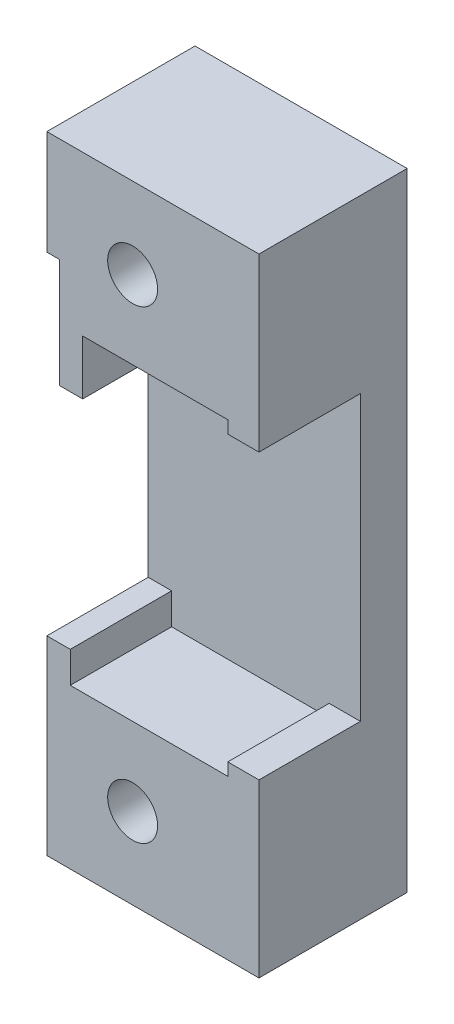
ISO-10303-21;
HEADER;
FILE_DESCRIPTION(('STEP AP214'),'2;1');
FILE_NAME('part.step','',(''),(''),'','','');
FILE_SCHEMA(('AUTOMOTIVE_DESIGN { 1 0 10303 214 1 1 1 1 }'));
ENDSEC;
DATA;
#1=APPLICATION_CONTEXT('core data for automotive mechanical design processes');
#2=APPLICATION_PROTOCOL_DEFINITION('international standard','automotive_design',2000,#1);
#3=PRODUCT_CONTEXT('',#1,'mechanical');
#4=PRODUCT('Part','Part','',(#3));
#5=PRODUCT_RELATED_PRODUCT_CATEGORY('part','',(#4));
#6=PRODUCT_DEFINITION_FORMATION('','',#4);
#7=PRODUCT_DEFINITION_CONTEXT('part definition',#1,'design');
#8=PRODUCT_DEFINITION('design','',#6,#7);
#9=PRODUCT_DEFINITION_SHAPE('','',#8);
#10=(LENGTH_UNIT() NAMED_UNIT(*) SI_UNIT(.MILLI.,.METRE.));
#11=(NAMED_UNIT(*) PLANE_ANGLE_UNIT() SI_UNIT($,.RADIAN.));
#12=(NAMED_UNIT(*) SI_UNIT($,.STERADIAN.) SOLID_ANGLE_UNIT());
#13=UNCERTAINTY_MEASURE_WITH_UNIT(LENGTH_MEASURE(1.E-05),#10,'distance_accuracy_value','');
#14=(GEOMETRIC_REPRESENTATION_CONTEXT(3) GLOBAL_UNCERTAINTY_ASSIGNED_CONTEXT((#13)) GLOBAL_UNIT_ASSIGNED_CONTEXT((#10,
#11,#12)) REPRESENTATION_CONTEXT('',''));
#15=CARTESIAN_POINT('',(0.,0.,0.));
#16=DIRECTION('',(0.,0.,1.));
#17=DIRECTION('',(1.,0.,0.));
#18=AXIS2_PLACEMENT_3D('',#15,#16,#17);
#19=CARTESIAN_POINT('',(-10.1,0.,6.5));
#20=DIRECTION('',(1.,0.,0.));
#21=DIRECTION('',(0.,0.,-1.));
#22=AXIS2_PLACEMENT_3D('',#19,#20,#21);
#23=PLANE('',#22);
#24=DIRECTION('',(0.,-1.,0.));
#25=VECTOR('',#24,1.);
#26=CARTESIAN_POINT('',(-10.1,0.,0.));
#27=LINE('',#26,#25);
#28=CARTESIAN_POINT('',(-10.1,-7.9,0.));
#29=VERTEX_POINT('',#28);
#30=CARTESIAN_POINT('',(-10.1,-9.9,0.));
#31=VERTEX_POINT('',#30);
#32=EDGE_CURVE('E306',#29,#31,#27,.T.);
#33=ORIENTED_EDGE('',*,*,#32,.F.);
#34=DIRECTION('',(0.,0.,-1.));
#35=VECTOR('',#34,1.);
#36=CARTESIAN_POINT('',(-10.1,-7.9,6.5));
#37=LINE('',#36,#35);
#38=CARTESIAN_POINT('',(-10.1,-7.9,6.5));
#39=VERTEX_POINT('',#38);
#40=EDGE_CURVE('E11',#39,#29,#37,.T.);
#41=ORIENTED_EDGE('',*,*,#40,.F.);
#42=DIRECTION('',(0.,-1.,0.));
#43=VECTOR('',#42,1.);
#44=CARTESIAN_POINT('',(-10.1,0.,6.5));
#45=LINE('',#44,#43);
#46=CARTESIAN_POINT('',(-10.1,-9.9,6.5));
#47=VERTEX_POINT('',#46);
#48=EDGE_CURVE('E309',#39,#47,#45,.T.);
#49=ORIENTED_EDGE('',*,*,#48,.T.);
#50=DIRECTION('',(0.,0.,-1.));
#51=VECTOR('',#50,1.);
#52=CARTESIAN_POINT('',(-10.1,-9.9,6.5));
#53=LINE('',#52,#51);
#54=EDGE_CURVE('E344',#47,#31,#53,.T.);
#55=ORIENTED_EDGE('',*,*,#54,.T.);
#56=EDGE_LOOP('',(#33,#41,#49,#55));
#57=FACE_BOUND('',#56,.T.);
#58=ADVANCED_FACE('F47',(#57),#23,.T.);
#59=CARTESIAN_POINT('',(0.,-7.9,6.5));
#60=DIRECTION('',(0.,1.,0.));
#61=DIRECTION('',(0.,0.,1.));
#62=AXIS2_PLACEMENT_3D('',#59,#60,#61);
#63=PLANE('',#62);
#64=DIRECTION('',(1.,0.,0.));
#65=VECTOR('',#64,1.);
#66=CARTESIAN_POINT('',(0.,-7.9,0.));
#67=LINE('',#66,#65);
#68=CARTESIAN_POINT('',(-11.6,-7.9,0.));
#69=VERTEX_POINT('',#68);
#70=EDGE_CURVE('E348',#69,#29,#67,.T.);
#71=ORIENTED_EDGE('',*,*,#70,.F.);
#72=DIRECTION('',(0.,0.,-1.));
#73=VECTOR('',#72,1.);
#74=CARTESIAN_POINT('',(-11.6,-7.9,6.5));
#75=LINE('',#74,#73);
#76=CARTESIAN_POINT('',(-11.6,-7.9,6.5));
#77=VERTEX_POINT('',#76);
#78=EDGE_CURVE('E56',#77,#69,#75,.T.);
#79=ORIENTED_EDGE('',*,*,#78,.F.);
#80=DIRECTION('',(1.,0.,0.));
#81=VECTOR('',#80,1.);
#82=CARTESIAN_POINT('',(0.,-7.9,6.5));
#83=LINE('',#82,#81);
#84=EDGE_CURVE('E313',#77,#39,#83,.T.);
#85=ORIENTED_EDGE('',*,*,#84,.T.);
#86=ORIENTED_EDGE('',*,*,#40,.T.);
#87=EDGE_LOOP('',(#71,#79,#85,#86));
#88=FACE_BOUND('',#87,.T.);
#89=ADVANCED_FACE('F420',(#88),#63,.T.);
#90=CARTESIAN_POINT('',(-11.6,0.,6.5));
#91=DIRECTION('',(-1.,0.,0.));
#92=DIRECTION('',(0.,-1.,0.));
#93=AXIS2_PLACEMENT_3D('',#90,#91,#92);
#94=PLANE('',#93);
#95=ORIENTED_EDGE('',*,*,#78,.T.);
#96=DIRECTION('',(0.,1.,0.));
#97=VECTOR('',#96,1.);
#98=CARTESIAN_POINT('',(-11.6,0.,0.));
#99=LINE('',#98,#97);
#100=CARTESIAN_POINT('',(-11.6,13.4,0.));
#101=VERTEX_POINT('',#100);
#102=EDGE_CURVE('E180',#69,#101,#99,.T.);
#103=ORIENTED_EDGE('',*,*,#102,.T.);
#104=DIRECTION('',(0.,0.,-1.));
#105=VECTOR('',#104,1.);
#106=CARTESIAN_POINT('',(-11.6,13.4,6.5));
#107=LINE('',#106,#105);
#108=CARTESIAN_POINT('',(-11.6,13.4,6.5));
#109=VERTEX_POINT('',#108);
#110=EDGE_CURVE('E174',#109,#101,#107,.T.);
#111=ORIENTED_EDGE('',*,*,#110,.F.);
#112=DIRECTION('',(0.,1.,0.));
#113=VECTOR('',#112,1.);
#114=CARTESIAN_POINT('',(-11.6,0.,6.5));
#115=LINE('',#114,#113);
#116=CARTESIAN_POINT('',(-11.6,20.1,6.5));
#117=VERTEX_POINT('',#116);
#118=EDGE_CURVE('E178',#109,#117,#115,.T.);
#119=ORIENTED_EDGE('',*,*,#118,.T.);
#120=DIRECTION('',(0.,0.,1.));
#121=VECTOR('',#120,1.);
#122=CARTESIAN_POINT('',(-11.6,20.1,-3.));
#123=LINE('',#122,#121);
#124=CARTESIAN_POINT('',(-11.6,20.1,-3.));
#125=VERTEX_POINT('',#124);
#126=EDGE_CURVE('E303',#125,#117,#123,.T.);
#127=ORIENTED_EDGE('',*,*,#126,.F.);
#128=DIRECTION('',(0.,1.,0.));
#129=VECTOR('',#128,1.);
#130=CARTESIAN_POINT('',(-11.6,0.,-3.));
#131=LINE('',#130,#129);
#132=CARTESIAN_POINT('',(-11.6,-20.1,-3.));
#133=VERTEX_POINT('',#132);
#134=EDGE_CURVE('E282',#133,#125,#131,.T.);
#135=ORIENTED_EDGE('',*,*,#134,.F.);
#136=DIRECTION('',(0.,0.,-1.));
#137=VECTOR('',#136,1.);
#138=CARTESIAN_POINT('',(-11.6,-20.1,6.5));
#139=LINE('',#138,#137);
#140=CARTESIAN_POINT('',(-11.6,-20.1,6.5));
#141=VERTEX_POINT('',#140);
#142=EDGE_CURVE('E377',#141,#133,#139,.T.);
#143=ORIENTED_EDGE('',*,*,#142,.F.);
#144=DIRECTION('',(0.,1.,0.));
#145=VECTOR('',#144,1.);
#146=CARTESIAN_POINT('',(-11.6,0.,6.5));
#147=LINE('',#146,#145);
#148=EDGE_CURVE('E318',#141,#77,#147,.T.);
#149=ORIENTED_EDGE('',*,*,#148,.T.);
#150=EDGE_LOOP('',(#95,#103,#111,#119,#127,#135,#143,#149));
#151=FACE_BOUND('',#150,.T.);
#152=ADVANCED_FACE('F176',(#151),#94,.T.);
#153=CARTESIAN_POINT('',(0.,-20.1,6.5));
#154=DIRECTION('',(0.,-1.,0.));
#155=DIRECTION('',(0.,0.,-1.));
#156=AXIS2_PLACEMENT_3D('',#153,#154,#155);
#157=PLANE('',#156);
#158=ORIENTED_EDGE('',*,*,#142,.T.);
#159=DIRECTION('',(-1.,0.,0.));
#160=VECTOR('',#159,1.);
#161=CARTESIAN_POINT('',(0.,-20.1,-3.));
#162=LINE('',#161,#160);
#163=CARTESIAN_POINT('',(2.,-20.1,-3.));
#164=VERTEX_POINT('',#163);
#165=EDGE_CURVE('E285',#164,#133,#162,.T.);
#166=ORIENTED_EDGE('',*,*,#165,.F.);
#167=DIRECTION('',(0.,0.,-1.));
#168=VECTOR('',#167,1.);
#169=CARTESIAN_POINT('',(2.,-20.1,6.5));
#170=LINE('',#169,#168);
#171=CARTESIAN_POINT('',(2.,-20.1,6.5));
#172=VERTEX_POINT('',#171);
#173=EDGE_CURVE('E374',#172,#164,#170,.T.);
#174=ORIENTED_EDGE('',*,*,#173,.F.);
#175=DIRECTION('',(-1.,0.,0.));
#176=VECTOR('',#175,1.);
#177=CARTESIAN_POINT('',(0.,-20.1,6.5));
#178=LINE('',#177,#176);
#179=EDGE_CURVE('E322',#172,#141,#178,.T.);
#180=ORIENTED_EDGE('',*,*,#179,.T.);
#181=EDGE_LOOP('',(#158,#166,#174,#180));
#182=FACE_BOUND('',#181,.T.);
#183=ADVANCED_FACE('F498',(#182),#157,.T.);
#184=CARTESIAN_POINT('',(2.,0.,6.5));
#185=DIRECTION('',(1.,0.,0.));
#186=DIRECTION('',(0.,1.,0.));
#187=AXIS2_PLACEMENT_3D('',#184,#185,#186);
#188=PLANE('',#187);
#189=ORIENTED_EDGE('',*,*,#173,.T.);
#190=DIRECTION('',(0.,1.,0.));
#191=VECTOR('',#190,1.);
#192=CARTESIAN_POINT('',(2.,0.,-3.));
#193=LINE('',#192,#191);
#194=CARTESIAN_POINT('',(2.,20.1,-3.));
#195=VERTEX_POINT('',#194);
#196=EDGE_CURVE('E290',#164,#195,#193,.T.);
#197=ORIENTED_EDGE('',*,*,#196,.T.);
#198=DIRECTION('',(0.,0.,1.));
#199=VECTOR('',#198,1.);
#200=CARTESIAN_POINT('',(2.,20.1,-3.));
#201=LINE('',#200,#199);
#202=CARTESIAN_POINT('',(2.,20.1,6.5));
#203=VERTEX_POINT('',#202);
#204=EDGE_CURVE('E298',#195,#203,#201,.T.);
#205=ORIENTED_EDGE('',*,*,#204,.T.);
#206=DIRECTION('',(0.,1.,0.));
#207=VECTOR('',#206,1.);
#208=CARTESIAN_POINT('',(2.,0.,6.5));
#209=LINE('',#208,#207);
#210=CARTESIAN_POINT('',(2.,9.1,6.5));
#211=VERTEX_POINT('',#210);
#212=EDGE_CURVE('E227',#211,#203,#209,.T.);
#213=ORIENTED_EDGE('',*,*,#212,.F.);
#214=DIRECTION('',(0.,0.,-1.));
#215=VECTOR('',#214,1.);
#216=CARTESIAN_POINT('',(2.,9.1,6.5));
#217=LINE('',#216,#215);
#218=CARTESIAN_POINT('',(2.,9.1,0.));
#219=VERTEX_POINT('',#218);
#220=EDGE_CURVE('E236',#211,#219,#217,.T.);
#221=ORIENTED_EDGE('',*,*,#220,.T.);
#222=DIRECTION('',(0.,1.,0.));
#223=VECTOR('',#222,1.);
#224=CARTESIAN_POINT('',(2.,0.,0.));
#225=LINE('',#224,#223);
#226=CARTESIAN_POINT('',(2.,-9.1,0.));
#227=VERTEX_POINT('',#226);
#228=EDGE_CURVE('E286',#227,#219,#225,.T.);
#229=ORIENTED_EDGE('',*,*,#228,.F.);
#230=DIRECTION('',(0.,0.,-1.));
#231=VECTOR('',#230,1.);
#232=CARTESIAN_POINT('',(2.,-9.1,6.5));
#233=LINE('',#232,#231);
#234=CARTESIAN_POINT('',(2.,-9.1,6.5));
#235=VERTEX_POINT('',#234);
#236=EDGE_CURVE('E371',#235,#227,#233,.T.);
#237=ORIENTED_EDGE('',*,*,#236,.F.);
#238=DIRECTION('',(0.,-1.,0.));
#239=VECTOR('',#238,1.);
#240=CARTESIAN_POINT('',(2.,0.,6.5));
#241=LINE('',#240,#239);
#242=EDGE_CURVE('E325',#235,#172,#241,.T.);
#243=ORIENTED_EDGE('',*,*,#242,.T.);
#244=EDGE_LOOP('',(#189,#197,#205,#213,#221,#229,#237,#243));
#245=FACE_BOUND('',#244,.T.);
#246=ADVANCED_FACE('F490',(#245),#188,.T.);
#247=CARTESIAN_POINT('',(0.,-9.1,6.5));
#248=DIRECTION('',(0.,1.,0.));
#249=DIRECTION('',(0.,0.,1.));
#250=AXIS2_PLACEMENT_3D('',#247,#248,#249);
#251=PLANE('',#250);
#252=DIRECTION('',(1.,0.,0.));
#253=VECTOR('',#252,1.);
#254=CARTESIAN_POINT('',(0.,-9.1,0.));
#255=LINE('',#254,#253);
#256=CARTESIAN_POINT('',(0.,-9.1,0.));
#257=VERTEX_POINT('',#256);
#258=EDGE_CURVE('E352',#257,#227,#255,.T.);
#259=ORIENTED_EDGE('',*,*,#258,.F.);
#260=DIRECTION('',(0.,0.,-1.));
#261=VECTOR('',#260,1.);
#262=CARTESIAN_POINT('',(0.,-9.1,6.5));
#263=LINE('',#262,#261);
#264=CARTESIAN_POINT('',(0.,-9.1,6.5));
#265=VERTEX_POINT('',#264);
#266=EDGE_CURVE('E368',#265,#257,#263,.T.);
#267=ORIENTED_EDGE('',*,*,#266,.F.);
#268=DIRECTION('',(1.,0.,0.));
#269=VECTOR('',#268,1.);
#270=CARTESIAN_POINT('',(0.,-9.1,6.5));
#271=LINE('',#270,#269);
#272=EDGE_CURVE('E329',#265,#235,#271,.T.);
#273=ORIENTED_EDGE('',*,*,#272,.T.);
#274=ORIENTED_EDGE('',*,*,#236,.T.);
#275=EDGE_LOOP('',(#259,#267,#273,#274));
#276=FACE_BOUND('',#275,.T.);
#277=ADVANCED_FACE('F504',(#276),#251,.T.);
#278=CARTESIAN_POINT('',(0.,0.,6.5));
#279=DIRECTION('',(-1.,0.,0.));
#280=DIRECTION('',(0.,0.,1.));
#281=AXIS2_PLACEMENT_3D('',#278,#279,#280);
#282=PLANE('',#281);
#283=DIRECTION('',(0.,1.,0.));
#284=VECTOR('',#283,1.);
#285=CARTESIAN_POINT('',(0.,0.,0.));
#286=LINE('',#285,#284);
#287=CARTESIAN_POINT('',(0.,-9.9,0.));
#288=VERTEX_POINT('',#287);
#289=EDGE_CURVE('E356',#288,#257,#286,.T.);
#290=ORIENTED_EDGE('',*,*,#289,.F.);
#291=DIRECTION('',(0.,0.,-1.));
#292=VECTOR('',#291,1.);
#293=CARTESIAN_POINT('',(0.,-9.9,6.5));
#294=LINE('',#293,#292);
#295=CARTESIAN_POINT('',(0.,-9.9,6.5));
#296=VERTEX_POINT('',#295);
#297=EDGE_CURVE('E365',#296,#288,#294,.T.);
#298=ORIENTED_EDGE('',*,*,#297,.F.);
#299=DIRECTION('',(0.,1.,0.));
#300=VECTOR('',#299,1.);
#301=CARTESIAN_POINT('',(0.,0.,6.5));
#302=LINE('',#301,#300);
#303=EDGE_CURVE('E333',#296,#265,#302,.T.);
#304=ORIENTED_EDGE('',*,*,#303,.T.);
#305=ORIENTED_EDGE('',*,*,#266,.T.);
#306=EDGE_LOOP('',(#290,#298,#304,#305));
#307=FACE_BOUND('',#306,.T.);
#308=ADVANCED_FACE('F507',(#307),#282,.T.);
#309=CARTESIAN_POINT('',(0.,-9.9,6.5));
#310=DIRECTION('',(0.,-1.,0.));
#311=DIRECTION('',(0.,0.,-1.));
#312=AXIS2_PLACEMENT_3D('',#309,#310,#311);
#313=PLANE('',#312);
#314=DIRECTION('',(-1.,0.,0.));
#315=VECTOR('',#314,1.);
#316=CARTESIAN_POINT('',(0.,-9.9,0.));
#317=LINE('',#316,#315);
#318=EDGE_CURVE('E314',#288,#31,#317,.T.);
#319=ORIENTED_EDGE('',*,*,#318,.T.);
#320=ORIENTED_EDGE('',*,*,#54,.F.);
#321=DIRECTION('',(-1.,0.,0.));
#322=VECTOR('',#321,1.);
#323=CARTESIAN_POINT('',(0.,-9.9,6.5));
#324=LINE('',#323,#322);
#325=EDGE_CURVE('E337',#296,#47,#324,.T.);
#326=ORIENTED_EDGE('',*,*,#325,.F.);
#327=ORIENTED_EDGE('',*,*,#297,.T.);
#328=EDGE_LOOP('',(#319,#320,#326,#327));
#329=FACE_BOUND('',#328,.T.);
#330=ADVANCED_FACE('F405',(#329),#313,.F.);
#331=CARTESIAN_POINT('',(-6.1,-14.9,6.5));
#332=DIRECTION('',(0.,0.,-1.));
#333=DIRECTION('',(-1.,0.,0.));
#334=AXIS2_PLACEMENT_3D('',#331,#332,#333);
#335=CYLINDRICAL_SURFACE('',#334,1.6);
#336=CARTESIAN_POINT('',(-6.1,-14.9,0.5));
#337=DIRECTION('',(0.,0.,1.));
#338=DIRECTION('',(1.,0.,0.));
#339=AXIS2_PLACEMENT_3D('',#336,#337,#338);
#340=CIRCLE('',#339,1.6);
#341=CARTESIAN_POINT('',(-4.5,-14.9,0.5));
#342=VERTEX_POINT('',#341);
#343=EDGE_CURVE('E50',#342,#342,#340,.T.);
#344=ORIENTED_EDGE('',*,*,#343,.F.);
#345=EDGE_LOOP('',(#344));
#346=FACE_BOUND('',#345,.T.);
#347=CARTESIAN_POINT('',(-6.1,-14.9,6.5));
#348=DIRECTION('',(0.,0.,1.));
#349=DIRECTION('',(1.,0.,0.));
#350=AXIS2_PLACEMENT_3D('',#347,#348,#349);
#351=CIRCLE('',#350,1.6);
#352=CARTESIAN_POINT('',(-4.5,-14.9,6.5));
#353=VERTEX_POINT('',#352);
#354=EDGE_CURVE('E340',#353,#353,#351,.T.);
#355=ORIENTED_EDGE('',*,*,#354,.T.);
#356=EDGE_LOOP('',(#355));
#357=FACE_BOUND('',#356,.T.);
#358=ADVANCED_FACE('F401',(#346,#357),#335,.F.);
#359=CARTESIAN_POINT('',(0.,0.,6.5));
#360=DIRECTION('',(0.,0.,1.));
#361=DIRECTION('',(1.,0.,0.));
#362=AXIS2_PLACEMENT_3D('',#359,#360,#361);
#363=PLANE('',#362);
#364=ORIENTED_EDGE('',*,*,#48,.F.);
#365=ORIENTED_EDGE('',*,*,#84,.F.);
#366=ORIENTED_EDGE('',*,*,#148,.F.);
#367=ORIENTED_EDGE('',*,*,#179,.F.);
#368=ORIENTED_EDGE('',*,*,#242,.F.);
#369=ORIENTED_EDGE('',*,*,#272,.F.);
#370=ORIENTED_EDGE('',*,*,#303,.F.);
#371=ORIENTED_EDGE('',*,*,#325,.T.);
#372=EDGE_LOOP('',(#364,#365,#366,#367,#368,#369,#370,#371));
#373=FACE_BOUND('',#372,.T.);
#374=ORIENTED_EDGE('',*,*,#354,.F.);
#375=EDGE_LOOP('',(#374));
#376=FACE_BOUND('',#375,.T.);
#377=ADVANCED_FACE('F404',(#373,#376),#363,.T.);
#378=CARTESIAN_POINT('',(0.,20.1,-3.));
#379=DIRECTION('',(0.,1.,0.));
#380=DIRECTION('',(0.,0.,1.));
#381=AXIS2_PLACEMENT_3D('',#378,#379,#380);
#382=PLANE('',#381);
#383=ORIENTED_EDGE('',*,*,#126,.T.);
#384=DIRECTION('',(-1.,0.,0.));
#385=VECTOR('',#384,1.);
#386=CARTESIAN_POINT('',(0.,20.1,6.5));
#387=LINE('',#386,#385);
#388=EDGE_CURVE('E197',#203,#117,#387,.T.);
#389=ORIENTED_EDGE('',*,*,#388,.F.);
#390=ORIENTED_EDGE('',*,*,#204,.F.);
#391=DIRECTION('',(-1.,0.,0.));
#392=VECTOR('',#391,1.);
#393=CARTESIAN_POINT('',(0.,20.1,-3.));
#394=LINE('',#393,#392);
#395=EDGE_CURVE('E294',#195,#125,#394,.T.);
#396=ORIENTED_EDGE('',*,*,#395,.T.);
#397=EDGE_LOOP('',(#383,#389,#390,#396));
#398=FACE_BOUND('',#397,.T.);
#399=ADVANCED_FACE('F410',(#398),#382,.T.);
#400=CARTESIAN_POINT('',(-6.1,14.9,-3.));
#401=DIRECTION('',(0.,0.,1.));
#402=DIRECTION('',(1.,0.,0.));
#403=AXIS2_PLACEMENT_3D('',#400,#401,#402);
#404=CYLINDRICAL_SURFACE('',#403,1.60000000000001);
#405=CARTESIAN_POINT('',(-6.1,14.9,0.5));
#406=DIRECTION('',(0.,0.,1.));
#407=DIRECTION('',(1.,0.,0.));
#408=AXIS2_PLACEMENT_3D('',#405,#406,#407);
#409=CIRCLE('',#408,1.60000000000001);
#410=CARTESIAN_POINT('',(-4.5,14.9,0.5));
#411=VERTEX_POINT('',#410);
#412=EDGE_CURVE('E390',#411,#411,#409,.F.);
#413=ORIENTED_EDGE('',*,*,#412,.T.);
#414=EDGE_LOOP('',(#413));
#415=FACE_BOUND('',#414,.T.);
#416=CARTESIAN_POINT('',(-6.1,14.9,6.5));
#417=DIRECTION('',(0.,0.,1.));
#418=DIRECTION('',(1.,0.,0.));
#419=AXIS2_PLACEMENT_3D('',#416,#417,#418);
#420=CIRCLE('',#419,1.60000000000001);
#421=CARTESIAN_POINT('',(-4.5,14.9,6.5));
#422=VERTEX_POINT('',#421);
#423=EDGE_CURVE('E232',#422,#422,#420,.T.);
#424=ORIENTED_EDGE('',*,*,#423,.T.);
#425=EDGE_LOOP('',(#424));
#426=FACE_BOUND('',#425,.T.);
#427=ADVANCED_FACE('F415',(#415,#426),#404,.F.);
#428=CARTESIAN_POINT('',(0.,0.,-3.));
#429=DIRECTION('',(0.,0.,1.));
#430=DIRECTION('',(1.,0.,0.));
#431=AXIS2_PLACEMENT_3D('',#428,#429,#430);
#432=PLANE('',#431);
#433=CARTESIAN_POINT('',(-6.1,14.9,-3.));
#434=DIRECTION('',(0.,0.,1.));
#435=DIRECTION('',(1.,0.,0.));
#436=AXIS2_PLACEMENT_3D('',#433,#434,#435);
#437=CIRCLE('',#436,2.85000000000001);
#438=CARTESIAN_POINT('',(-3.25,14.9,-3.));
#439=VERTEX_POINT('',#438);
#440=EDGE_CURVE('E386',#439,#439,#437,.T.);
#441=ORIENTED_EDGE('',*,*,#440,.T.);
#442=EDGE_LOOP('',(#441));
#443=FACE_BOUND('',#442,.T.);
#444=CARTESIAN_POINT('',(-6.1,-14.9,-3.));
#445=DIRECTION('',(0.,0.,1.));
#446=DIRECTION('',(1.,0.,0.));
#447=AXIS2_PLACEMENT_3D('',#444,#445,#446);
#448=CIRCLE('',#447,2.85);
#449=CARTESIAN_POINT('',(-3.24999999999999,-14.9,-3.));
#450=VERTEX_POINT('',#449);
#451=EDGE_CURVE('E382',#450,#450,#448,.T.);
#452=ORIENTED_EDGE('',*,*,#451,.T.);
#453=EDGE_LOOP('',(#452));
#454=FACE_BOUND('',#453,.T.);
#455=ORIENTED_EDGE('',*,*,#134,.T.);
#456=ORIENTED_EDGE('',*,*,#395,.F.);
#457=ORIENTED_EDGE('',*,*,#196,.F.);
#458=ORIENTED_EDGE('',*,*,#165,.T.);
#459=EDGE_LOOP('',(#455,#456,#457,#458));
#460=FACE_BOUND('',#459,.T.);
#461=ADVANCED_FACE('F431',(#443,#454,#460),#432,.F.);
#462=CARTESIAN_POINT('',(0.,0.,0.));
#463=DIRECTION('',(0.,0.,1.));
#464=DIRECTION('',(1.,0.,0.));
#465=AXIS2_PLACEMENT_3D('',#462,#463,#464);
#466=PLANE('',#465);
#467=DIRECTION('',(-1.,0.,0.));
#468=VECTOR('',#467,1.);
#469=CARTESIAN_POINT('',(0.,13.4,0.));
#470=LINE('',#469,#468);
#471=CARTESIAN_POINT('',(-10.8,13.4,0.));
#472=VERTEX_POINT('',#471);
#473=EDGE_CURVE('E237',#472,#101,#470,.T.);
#474=ORIENTED_EDGE('',*,*,#473,.T.);
#475=ORIENTED_EDGE('',*,*,#102,.F.);
#476=ORIENTED_EDGE('',*,*,#70,.T.);
#477=ORIENTED_EDGE('',*,*,#32,.T.);
#478=ORIENTED_EDGE('',*,*,#318,.F.);
#479=ORIENTED_EDGE('',*,*,#289,.T.);
#480=ORIENTED_EDGE('',*,*,#258,.T.);
#481=ORIENTED_EDGE('',*,*,#228,.T.);
#482=DIRECTION('',(1.,0.,0.));
#483=VECTOR('',#482,1.);
#484=CARTESIAN_POINT('',(0.,9.1,0.));
#485=LINE('',#484,#483);
#486=CARTESIAN_POINT('',(0.,9.1,0.));
#487=VERTEX_POINT('',#486);
#488=EDGE_CURVE('E199',#487,#219,#485,.T.);
#489=ORIENTED_EDGE('',*,*,#488,.F.);
#490=DIRECTION('',(0.,-1.,0.));
#491=VECTOR('',#490,1.);
#492=CARTESIAN_POINT('',(0.,0.,0.));
#493=LINE('',#492,#491);
#494=CARTESIAN_POINT('',(0.,9.9,0.));
#495=VERTEX_POINT('',#494);
#496=EDGE_CURVE('E251',#495,#487,#493,.T.);
#497=ORIENTED_EDGE('',*,*,#496,.F.);
#498=DIRECTION('',(-1.,0.,0.));
#499=VECTOR('',#498,1.);
#500=CARTESIAN_POINT('',(0.,9.9,0.));
#501=LINE('',#500,#499);
#502=CARTESIAN_POINT('',(-9.3,9.9,0.));
#503=VERTEX_POINT('',#502);
#504=EDGE_CURVE('E248',#495,#503,#501,.T.);
#505=ORIENTED_EDGE('',*,*,#504,.T.);
#506=DIRECTION('',(0.,1.,0.));
#507=VECTOR('',#506,1.);
#508=CARTESIAN_POINT('',(-9.3,0.,0.));
#509=LINE('',#508,#507);
#510=CARTESIAN_POINT('',(-9.3,6.4,0.));
#511=VERTEX_POINT('',#510);
#512=EDGE_CURVE('E244',#511,#503,#509,.T.);
#513=ORIENTED_EDGE('',*,*,#512,.F.);
#514=DIRECTION('',(1.,0.,0.));
#515=VECTOR('',#514,1.);
#516=CARTESIAN_POINT('',(0.,6.4,0.));
#517=LINE('',#516,#515);
#518=CARTESIAN_POINT('',(-10.8,6.4,0.));
#519=VERTEX_POINT('',#518);
#520=EDGE_CURVE('E69',#519,#511,#517,.T.);
#521=ORIENTED_EDGE('',*,*,#520,.F.);
#522=DIRECTION('',(0.,1.,0.));
#523=VECTOR('',#522,1.);
#524=CARTESIAN_POINT('',(-10.8,0.,0.));
#525=LINE('',#524,#523);
#526=EDGE_CURVE('E64',#519,#472,#525,.T.);
#527=ORIENTED_EDGE('',*,*,#526,.T.);
#528=EDGE_LOOP('',(#474,#475,#476,#477,#478,#479,#480,#481,#489,#497,#505,#513,#521,#527));
#529=FACE_BOUND('',#528,.T.);
#530=ADVANCED_FACE('F429',(#529),#466,.T.);
#531=CARTESIAN_POINT('',(0.,13.4,6.5));
#532=DIRECTION('',(0.,-1.,0.));
#533=DIRECTION('',(1.,0.,0.));
#534=AXIS2_PLACEMENT_3D('',#531,#532,#533);
#535=PLANE('',#534);
#536=ORIENTED_EDGE('',*,*,#473,.F.);
#537=DIRECTION('',(0.,0.,-1.));
#538=VECTOR('',#537,1.);
#539=CARTESIAN_POINT('',(-10.8,13.4,6.5));
#540=LINE('',#539,#538);
#541=CARTESIAN_POINT('',(-10.8,13.4,6.5));
#542=VERTEX_POINT('',#541);
#543=EDGE_CURVE('E185',#542,#472,#540,.T.);
#544=ORIENTED_EDGE('',*,*,#543,.F.);
#545=DIRECTION('',(-1.,0.,0.));
#546=VECTOR('',#545,1.);
#547=CARTESIAN_POINT('',(0.,13.4,6.5));
#548=LINE('',#547,#546);
#549=EDGE_CURVE('E193',#542,#109,#548,.T.);
#550=ORIENTED_EDGE('',*,*,#549,.T.);
#551=ORIENTED_EDGE('',*,*,#110,.T.);
#552=EDGE_LOOP('',(#536,#544,#550,#551));
#553=FACE_BOUND('',#552,.T.);
#554=ADVANCED_FACE('F201',(#553),#535,.T.);
#555=CARTESIAN_POINT('',(-10.8,0.,6.5));
#556=DIRECTION('',(-1.,0.,0.));
#557=DIRECTION('',(0.,0.,1.));
#558=AXIS2_PLACEMENT_3D('',#555,#556,#557);
#559=PLANE('',#558);
#560=ORIENTED_EDGE('',*,*,#526,.F.);
#561=DIRECTION('',(0.,0.,-1.));
#562=VECTOR('',#561,1.);
#563=CARTESIAN_POINT('',(-10.8,6.4,6.5));
#564=LINE('',#563,#562);
#565=CARTESIAN_POINT('',(-10.8,6.4,6.5));
#566=VERTEX_POINT('',#565);
#567=EDGE_CURVE('E277',#566,#519,#564,.T.);
#568=ORIENTED_EDGE('',*,*,#567,.F.);
#569=DIRECTION('',(0.,1.,0.));
#570=VECTOR('',#569,1.);
#571=CARTESIAN_POINT('',(-10.8,0.,6.5));
#572=LINE('',#571,#570);
#573=EDGE_CURVE('E203',#566,#542,#572,.T.);
#574=ORIENTED_EDGE('',*,*,#573,.T.);
#575=ORIENTED_EDGE('',*,*,#543,.T.);
#576=EDGE_LOOP('',(#560,#568,#574,#575));
#577=FACE_BOUND('',#576,.T.);
#578=ADVANCED_FACE('F436',(#577),#559,.T.);
#579=CARTESIAN_POINT('',(0.,6.4,6.5));
#580=DIRECTION('',(0.,1.,0.));
#581=DIRECTION('',(-1.,0.,0.));
#582=AXIS2_PLACEMENT_3D('',#579,#580,#581);
#583=PLANE('',#582);
#584=ORIENTED_EDGE('',*,*,#520,.T.);
#585=DIRECTION('',(0.,0.,-1.));
#586=VECTOR('',#585,1.);
#587=CARTESIAN_POINT('',(-9.3,6.4,6.5));
#588=LINE('',#587,#586);
#589=CARTESIAN_POINT('',(-9.3,6.4,6.5));
#590=VERTEX_POINT('',#589);
#591=EDGE_CURVE('E273',#590,#511,#588,.T.);
#592=ORIENTED_EDGE('',*,*,#591,.F.);
#593=DIRECTION('',(1.,0.,0.));
#594=VECTOR('',#593,1.);
#595=CARTESIAN_POINT('',(0.,6.4,6.5));
#596=LINE('',#595,#594);
#597=EDGE_CURVE('E208',#566,#590,#596,.T.);
#598=ORIENTED_EDGE('',*,*,#597,.F.);
#599=ORIENTED_EDGE('',*,*,#567,.T.);
#600=EDGE_LOOP('',(#584,#592,#598,#599));
#601=FACE_BOUND('',#600,.T.);
#602=ADVANCED_FACE('F469',(#601),#583,.F.);
#603=CARTESIAN_POINT('',(-9.3,0.,6.5));
#604=DIRECTION('',(-1.,0.,0.));
#605=DIRECTION('',(0.,0.,1.));
#606=AXIS2_PLACEMENT_3D('',#603,#604,#605);
#607=PLANE('',#606);
#608=ORIENTED_EDGE('',*,*,#512,.T.);
#609=DIRECTION('',(0.,0.,-1.));
#610=VECTOR('',#609,1.);
#611=CARTESIAN_POINT('',(-9.3,9.9,6.5));
#612=LINE('',#611,#610);
#613=CARTESIAN_POINT('',(-9.3,9.9,6.5));
#614=VERTEX_POINT('',#613);
#615=EDGE_CURVE('E269',#614,#503,#612,.T.);
#616=ORIENTED_EDGE('',*,*,#615,.F.);
#617=DIRECTION('',(0.,1.,0.));
#618=VECTOR('',#617,1.);
#619=CARTESIAN_POINT('',(-9.3,0.,6.5));
#620=LINE('',#619,#618);
#621=EDGE_CURVE('E214',#590,#614,#620,.T.);
#622=ORIENTED_EDGE('',*,*,#621,.F.);
#623=ORIENTED_EDGE('',*,*,#591,.T.);
#624=EDGE_LOOP('',(#608,#616,#622,#623));
#625=FACE_BOUND('',#624,.T.);
#626=ADVANCED_FACE('F465',(#625),#607,.F.);
#627=CARTESIAN_POINT('',(0.,9.9,6.5));
#628=DIRECTION('',(0.,-1.,0.));
#629=DIRECTION('',(1.,0.,0.));
#630=AXIS2_PLACEMENT_3D('',#627,#628,#629);
#631=PLANE('',#630);
#632=ORIENTED_EDGE('',*,*,#504,.F.);
#633=DIRECTION('',(0.,0.,-1.));
#634=VECTOR('',#633,1.);
#635=CARTESIAN_POINT('',(0.,9.9,6.5));
#636=LINE('',#635,#634);
#637=CARTESIAN_POINT('',(0.,9.9,6.5));
#638=VERTEX_POINT('',#637);
#639=EDGE_CURVE('E265',#638,#495,#636,.T.);
#640=ORIENTED_EDGE('',*,*,#639,.F.);
#641=DIRECTION('',(-1.,0.,0.));
#642=VECTOR('',#641,1.);
#643=CARTESIAN_POINT('',(0.,9.9,6.5));
#644=LINE('',#643,#642);
#645=EDGE_CURVE('E217',#638,#614,#644,.T.);
#646=ORIENTED_EDGE('',*,*,#645,.T.);
#647=ORIENTED_EDGE('',*,*,#615,.T.);
#648=EDGE_LOOP('',(#632,#640,#646,#647));
#649=FACE_BOUND('',#648,.T.);
#650=ADVANCED_FACE('F461',(#649),#631,.T.);
#651=CARTESIAN_POINT('',(0.,0.,6.5));
#652=DIRECTION('',(1.,0.,0.));
#653=DIRECTION('',(0.,1.,0.));
#654=AXIS2_PLACEMENT_3D('',#651,#652,#653);
#655=PLANE('',#654);
#656=ORIENTED_EDGE('',*,*,#496,.T.);
#657=DIRECTION('',(0.,0.,-1.));
#658=VECTOR('',#657,1.);
#659=CARTESIAN_POINT('',(0.,9.1,6.5));
#660=LINE('',#659,#658);
#661=CARTESIAN_POINT('',(0.,9.1,6.5));
#662=VERTEX_POINT('',#661);
#663=EDGE_CURVE('E261',#662,#487,#660,.T.);
#664=ORIENTED_EDGE('',*,*,#663,.F.);
#665=DIRECTION('',(0.,-1.,0.));
#666=VECTOR('',#665,1.);
#667=CARTESIAN_POINT('',(0.,0.,6.5));
#668=LINE('',#667,#666);
#669=EDGE_CURVE('E221',#638,#662,#668,.T.);
#670=ORIENTED_EDGE('',*,*,#669,.F.);
#671=ORIENTED_EDGE('',*,*,#639,.T.);
#672=EDGE_LOOP('',(#656,#664,#670,#671));
#673=FACE_BOUND('',#672,.T.);
#674=ADVANCED_FACE('F454',(#673),#655,.F.);
#675=CARTESIAN_POINT('',(0.,9.1,6.5));
#676=DIRECTION('',(0.,1.,0.));
#677=DIRECTION('',(-1.,0.,0.));
#678=AXIS2_PLACEMENT_3D('',#675,#676,#677);
#679=PLANE('',#678);
#680=ORIENTED_EDGE('',*,*,#488,.T.);
#681=ORIENTED_EDGE('',*,*,#220,.F.);
#682=DIRECTION('',(1.,0.,0.));
#683=VECTOR('',#682,1.);
#684=CARTESIAN_POINT('',(0.,9.1,6.5));
#685=LINE('',#684,#683);
#686=EDGE_CURVE('E224',#662,#211,#685,.T.);
#687=ORIENTED_EDGE('',*,*,#686,.F.);
#688=ORIENTED_EDGE('',*,*,#663,.T.);
#689=EDGE_LOOP('',(#680,#681,#687,#688));
#690=FACE_BOUND('',#689,.T.);
#691=ADVANCED_FACE('F447',(#690),#679,.F.);
#692=CARTESIAN_POINT('',(0.,0.,6.5));
#693=DIRECTION('',(0.,0.,1.));
#694=DIRECTION('',(1.,0.,0.));
#695=AXIS2_PLACEMENT_3D('',#692,#693,#694);
#696=PLANE('',#695);
#697=ORIENTED_EDGE('',*,*,#118,.F.);
#698=ORIENTED_EDGE('',*,*,#549,.F.);
#699=ORIENTED_EDGE('',*,*,#573,.F.);
#700=ORIENTED_EDGE('',*,*,#597,.T.);
#701=ORIENTED_EDGE('',*,*,#621,.T.);
#702=ORIENTED_EDGE('',*,*,#645,.F.);
#703=ORIENTED_EDGE('',*,*,#669,.T.);
#704=ORIENTED_EDGE('',*,*,#686,.T.);
#705=ORIENTED_EDGE('',*,*,#212,.T.);
#706=ORIENTED_EDGE('',*,*,#388,.T.);
#707=EDGE_LOOP('',(#697,#698,#699,#700,#701,#702,#703,#704,#705,#706));
#708=FACE_BOUND('',#707,.T.);
#709=ORIENTED_EDGE('',*,*,#423,.F.);
#710=EDGE_LOOP('',(#709));
#711=FACE_BOUND('',#710,.T.);
#712=ADVANCED_FACE('F190',(#708,#711),#696,.T.);
#713=CARTESIAN_POINT('',(-6.1,-14.9,-3.000012));
#714=DIRECTION('',(0.,0.,1.));
#715=DIRECTION('',(1.,0.,0.));
#716=AXIS2_PLACEMENT_3D('',#713,#714,#715);
#717=CYLINDRICAL_SURFACE('',#716,2.85);
#718=CARTESIAN_POINT('',(-6.1,-14.9,0.5));
#719=DIRECTION('',(0.,0.,1.));
#720=DIRECTION('',(1.,0.,0.));
#721=AXIS2_PLACEMENT_3D('',#718,#719,#720);
#722=CIRCLE('',#721,2.85);
#723=CARTESIAN_POINT('',(-3.24999999999999,-14.9,0.5));
#724=VERTEX_POINT('',#723);
#725=EDGE_CURVE('E782',#724,#724,#722,.T.);
#726=ORIENTED_EDGE('',*,*,#725,.T.);
#727=EDGE_LOOP('',(#726));
#728=FACE_BOUND('',#727,.T.);
#729=ORIENTED_EDGE('',*,*,#451,.F.);
#730=EDGE_LOOP('',(#729));
#731=FACE_BOUND('',#730,.T.);
#732=ADVANCED_FACE('F446',(#728,#731),#717,.F.);
#733=CARTESIAN_POINT('',(-6.1,-14.9,0.5));
#734=DIRECTION('',(0.,0.,1.));
#735=DIRECTION('',(1.,0.,0.));
#736=AXIS2_PLACEMENT_3D('',#733,#734,#735);
#737=PLANE('',#736);
#738=ORIENTED_EDGE('',*,*,#343,.T.);
#739=EDGE_LOOP('',(#738));
#740=FACE_BOUND('',#739,.T.);
#741=ORIENTED_EDGE('',*,*,#725,.F.);
#742=EDGE_LOOP('',(#741));
#743=FACE_BOUND('',#742,.T.);
#744=ADVANCED_FACE('F398',(#740,#743),#737,.F.);
#745=CARTESIAN_POINT('',(-6.1,14.9,0.5));
#746=DIRECTION('',(0.,0.,1.));
#747=DIRECTION('',(1.,0.,0.));
#748=AXIS2_PLACEMENT_3D('',#745,#746,#747);
#749=PLANE('',#748);
#750=CARTESIAN_POINT('',(-6.1,14.9,0.5));
#751=DIRECTION('',(0.,0.,1.));
#752=DIRECTION('',(1.,0.,0.));
#753=AXIS2_PLACEMENT_3D('',#750,#751,#752);
#754=CIRCLE('',#753,2.85000000000001);
#755=CARTESIAN_POINT('',(-3.25,14.9,0.5));
#756=VERTEX_POINT('',#755);
#757=EDGE_CURVE('E387',#756,#756,#754,.T.);
#758=ORIENTED_EDGE('',*,*,#757,.F.);
#759=EDGE_LOOP('',(#758));
#760=FACE_BOUND('',#759,.T.);
#761=ORIENTED_EDGE('',*,*,#412,.F.);
#762=EDGE_LOOP('',(#761));
#763=FACE_BOUND('',#762,.T.);
#764=ADVANCED_FACE('F629',(#760,#763),#749,.F.);
#765=CARTESIAN_POINT('',(-6.1,14.9,-3.000012));
#766=DIRECTION('',(0.,0.,1.));
#767=DIRECTION('',(1.,0.,0.));
#768=AXIS2_PLACEMENT_3D('',#765,#766,#767);
#769=CYLINDRICAL_SURFACE('',#768,2.85000000000001);
#770=ORIENTED_EDGE('',*,*,#757,.T.);
#771=EDGE_LOOP('',(#770));
#772=FACE_BOUND('',#771,.T.);
#773=ORIENTED_EDGE('',*,*,#440,.F.);
#774=EDGE_LOOP('',(#773));
#775=FACE_BOUND('',#774,.T.);
#776=ADVANCED_FACE('F637',(#772,#775),#769,.F.);
#777=CLOSED_SHELL('',(#58,#89,#152,#183,#246,#277,#308,#330,#358,#377,#399,#427,#461,#530,#554,
#578,#602,#626,#650,#674,#691,#712,#732,#744,#764,#776));
#778=MANIFOLD_SOLID_BREP('B2',#777);
#779=ADVANCED_BREP_SHAPE_REPRESENTATION('',(#18,#778),#14);
#780=SHAPE_DEFINITION_REPRESENTATION(#9,#779);
ENDSEC;
END-ISO-10303-21;
